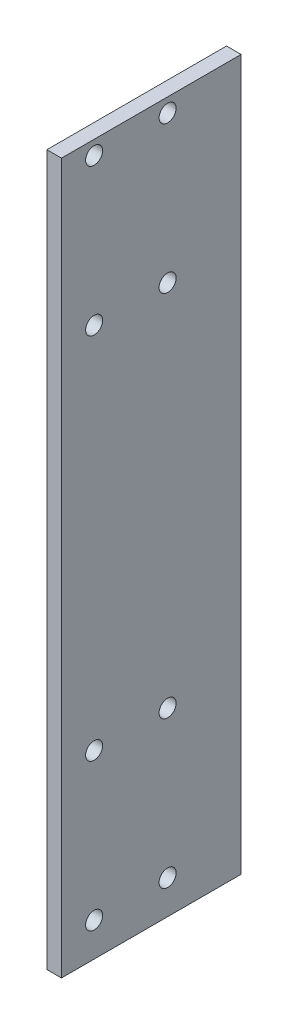
ISO-10303-21;
HEADER;
FILE_DESCRIPTION(('STEP AP214'),'2;1');
FILE_NAME('part.step','',(''),(''),'','','');
FILE_SCHEMA(('AUTOMOTIVE_DESIGN { 1 0 10303 214 1 1 1 1 }'));
ENDSEC;
DATA;
#1=APPLICATION_CONTEXT('core data for automotive mechanical design processes');
#2=APPLICATION_PROTOCOL_DEFINITION('international standard','automotive_design',2000,#1);
#3=PRODUCT_CONTEXT('',#1,'mechanical');
#4=PRODUCT('Part','Part','',(#3));
#5=PRODUCT_RELATED_PRODUCT_CATEGORY('part','',(#4));
#6=PRODUCT_DEFINITION_FORMATION('','',#4);
#7=PRODUCT_DEFINITION_CONTEXT('part definition',#1,'design');
#8=PRODUCT_DEFINITION('design','',#6,#7);
#9=PRODUCT_DEFINITION_SHAPE('','',#8);
#10=(LENGTH_UNIT() NAMED_UNIT(*) SI_UNIT(.MILLI.,.METRE.));
#11=(NAMED_UNIT(*) PLANE_ANGLE_UNIT() SI_UNIT($,.RADIAN.));
#12=(NAMED_UNIT(*) SI_UNIT($,.STERADIAN.) SOLID_ANGLE_UNIT());
#13=UNCERTAINTY_MEASURE_WITH_UNIT(LENGTH_MEASURE(1.E-05),#10,'distance_accuracy_value','');
#14=(GEOMETRIC_REPRESENTATION_CONTEXT(3) GLOBAL_UNCERTAINTY_ASSIGNED_CONTEXT((#13)) GLOBAL_UNIT_ASSIGNED_CONTEXT((#10,
#11,#12)) REPRESENTATION_CONTEXT('',''));
#15=CARTESIAN_POINT('',(0.,0.,0.));
#16=DIRECTION('',(0.,0.,1.));
#17=DIRECTION('',(1.,0.,0.));
#18=AXIS2_PLACEMENT_3D('',#15,#16,#17);
#19=CARTESIAN_POINT('',(3.175,0.,0.));
#20=DIRECTION('',(-1.,0.,0.));
#21=DIRECTION('',(0.,0.,1.));
#22=AXIS2_PLACEMENT_3D('',#19,#20,#21);
#23=PLANE('',#22);
#24=DIRECTION('',(0.,-1.,0.));
#25=VECTOR('',#24,1.);
#26=CARTESIAN_POINT('',(3.175,-23.3590702140001,82.));
#27=LINE('',#26,#25);
#28=CARTESIAN_POINT('',(3.175,131.25,82.));
#29=VERTEX_POINT('',#28);
#30=CARTESIAN_POINT('',(3.175,-23.3590702140001,82.));
#31=VERTEX_POINT('',#30);
#32=EDGE_CURVE('E85',#29,#31,#27,.T.);
#33=ORIENTED_EDGE('',*,*,#32,.T.);
#34=DIRECTION('',(0.,0.,-1.));
#35=VECTOR('',#34,1.);
#36=CARTESIAN_POINT('',(3.175,-23.3590702140001,82.));
#37=LINE('',#36,#35);
#38=CARTESIAN_POINT('',(3.175,-23.3590702140001,42.8868));
#39=VERTEX_POINT('',#38);
#40=EDGE_CURVE('E80',#31,#39,#37,.T.);
#41=ORIENTED_EDGE('',*,*,#40,.T.);
#42=DIRECTION('',(0.,1.,0.));
#43=VECTOR('',#42,1.);
#44=CARTESIAN_POINT('',(3.175,-23.3590702140001,42.8868));
#45=LINE('',#44,#43);
#46=CARTESIAN_POINT('',(3.175,131.25,42.8868));
#47=VERTEX_POINT('',#46);
#48=EDGE_CURVE('E83',#39,#47,#45,.T.);
#49=ORIENTED_EDGE('',*,*,#48,.T.);
#50=DIRECTION('',(0.,0.,1.));
#51=VECTOR('',#50,1.);
#52=CARTESIAN_POINT('',(3.175,131.25,82.));
#53=LINE('',#52,#51);
#54=EDGE_CURVE('E50',#47,#29,#53,.T.);
#55=ORIENTED_EDGE('',*,*,#54,.T.);
#56=EDGE_LOOP('',(#33,#41,#49,#55));
#57=FACE_BOUND('',#56,.T.);
#58=CARTESIAN_POINT('',(3.175,-16.000000003999,74.8897999999996));
#59=DIRECTION('',(1.,0.,0.));
#60=DIRECTION('',(0.,0.,-1.));
#61=AXIS2_PLACEMENT_3D('',#58,#59,#60);
#62=CIRCLE('',#61,1.8542);
#63=CARTESIAN_POINT('',(3.175,-16.000000003999,73.0355999999996));
#64=VERTEX_POINT('',#63);
#65=EDGE_CURVE('E100',#64,#64,#62,.T.);
#66=ORIENTED_EDGE('',*,*,#65,.F.);
#67=EDGE_LOOP('',(#66));
#68=FACE_BOUND('',#67,.T.);
#69=CARTESIAN_POINT('',(3.175,-16.000000003999,58.8897999999996));
#70=DIRECTION('',(1.,0.,0.));
#71=DIRECTION('',(0.,0.,-1.));
#72=AXIS2_PLACEMENT_3D('',#69,#70,#71);
#73=CIRCLE('',#72,1.8542);
#74=CARTESIAN_POINT('',(3.175,-16.000000003999,57.0355999999996));
#75=VERTEX_POINT('',#74);
#76=EDGE_CURVE('E115',#75,#75,#73,.T.);
#77=ORIENTED_EDGE('',*,*,#76,.F.);
#78=EDGE_LOOP('',(#77));
#79=FACE_BOUND('',#78,.T.);
#80=CARTESIAN_POINT('',(3.175,16.000000004001,74.8897999999996));
#81=DIRECTION('',(1.,0.,0.));
#82=DIRECTION('',(0.,0.,-1.));
#83=AXIS2_PLACEMENT_3D('',#80,#81,#82);
#84=CIRCLE('',#83,1.8542);
#85=CARTESIAN_POINT('',(3.175,16.000000004001,73.0355999999996));
#86=VERTEX_POINT('',#85);
#87=EDGE_CURVE('E121',#86,#86,#84,.T.);
#88=ORIENTED_EDGE('',*,*,#87,.F.);
#89=EDGE_LOOP('',(#88));
#90=FACE_BOUND('',#89,.T.);
#91=CARTESIAN_POINT('',(3.175,16.000000004001,58.8897999999996));
#92=DIRECTION('',(1.,0.,0.));
#93=DIRECTION('',(0.,0.,-1.));
#94=AXIS2_PLACEMENT_3D('',#91,#92,#93);
#95=CIRCLE('',#94,1.8542);
#96=CARTESIAN_POINT('',(3.175,16.000000004001,57.0355999999996));
#97=VERTEX_POINT('',#96);
#98=EDGE_CURVE('E127',#97,#97,#95,.T.);
#99=ORIENTED_EDGE('',*,*,#98,.F.);
#100=EDGE_LOOP('',(#99));
#101=FACE_BOUND('',#100,.T.);
#102=CARTESIAN_POINT('',(3.175,128.200000004,74.8897999999996));
#103=DIRECTION('',(1.,0.,0.));
#104=DIRECTION('',(0.,0.,-1.));
#105=AXIS2_PLACEMENT_3D('',#102,#103,#104);
#106=CIRCLE('',#105,1.8542);
#107=CARTESIAN_POINT('',(3.175,128.200000004,73.0355999999996));
#108=VERTEX_POINT('',#107);
#109=EDGE_CURVE('E133',#108,#108,#106,.T.);
#110=ORIENTED_EDGE('',*,*,#109,.F.);
#111=EDGE_LOOP('',(#110));
#112=FACE_BOUND('',#111,.T.);
#113=CARTESIAN_POINT('',(3.175,128.200000004,58.8897999999996));
#114=DIRECTION('',(1.,0.,0.));
#115=DIRECTION('',(0.,0.,-1.));
#116=AXIS2_PLACEMENT_3D('',#113,#114,#115);
#117=CIRCLE('',#116,1.8542);
#118=CARTESIAN_POINT('',(3.175,128.200000004,57.0355999999996));
#119=VERTEX_POINT('',#118);
#120=EDGE_CURVE('E139',#119,#119,#117,.T.);
#121=ORIENTED_EDGE('',*,*,#120,.F.);
#122=EDGE_LOOP('',(#121));
#123=FACE_BOUND('',#122,.T.);
#124=CARTESIAN_POINT('',(3.175,96.199999996,74.8897999999996));
#125=DIRECTION('',(1.,0.,0.));
#126=DIRECTION('',(0.,0.,-1.));
#127=AXIS2_PLACEMENT_3D('',#124,#125,#126);
#128=CIRCLE('',#127,1.8542);
#129=CARTESIAN_POINT('',(3.175,96.199999996,73.0355999999996));
#130=VERTEX_POINT('',#129);
#131=EDGE_CURVE('E145',#130,#130,#128,.T.);
#132=ORIENTED_EDGE('',*,*,#131,.F.);
#133=EDGE_LOOP('',(#132));
#134=FACE_BOUND('',#133,.T.);
#135=CARTESIAN_POINT('',(3.175,96.199999996,58.8897999999996));
#136=DIRECTION('',(1.,0.,0.));
#137=DIRECTION('',(0.,0.,-1.));
#138=AXIS2_PLACEMENT_3D('',#135,#136,#137);
#139=CIRCLE('',#138,1.85420000000001);
#140=CARTESIAN_POINT('',(3.175,96.199999996,57.0355999999996));
#141=VERTEX_POINT('',#140);
#142=EDGE_CURVE('E151',#141,#141,#139,.T.);
#143=ORIENTED_EDGE('',*,*,#142,.F.);
#144=EDGE_LOOP('',(#143));
#145=FACE_BOUND('',#144,.T.);
#146=ADVANCED_FACE('F33',(#57,#68,#79,#90,#101,#112,#123,#134,#145),#23,.F.);
#147=CARTESIAN_POINT('',(0.,0.,0.));
#148=DIRECTION('',(-1.,0.,0.));
#149=DIRECTION('',(0.,0.,1.));
#150=AXIS2_PLACEMENT_3D('',#147,#148,#149);
#151=PLANE('',#150);
#152=CARTESIAN_POINT('',(0.,96.199999996,74.8897999999996));
#153=DIRECTION('',(1.,0.,0.));
#154=DIRECTION('',(0.,0.,-1.));
#155=AXIS2_PLACEMENT_3D('',#152,#153,#154);
#156=CIRCLE('',#155,1.8542);
#157=CARTESIAN_POINT('',(0.,96.199999996,73.0355999999996));
#158=VERTEX_POINT('',#157);
#159=EDGE_CURVE('E148',#158,#158,#156,.T.);
#160=ORIENTED_EDGE('',*,*,#159,.T.);
#161=EDGE_LOOP('',(#160));
#162=FACE_BOUND('',#161,.T.);
#163=CARTESIAN_POINT('',(0.,128.200000004,74.8897999999996));
#164=DIRECTION('',(1.,0.,0.));
#165=DIRECTION('',(0.,0.,-1.));
#166=AXIS2_PLACEMENT_3D('',#163,#164,#165);
#167=CIRCLE('',#166,1.8542);
#168=CARTESIAN_POINT('',(0.,128.200000004,73.0355999999996));
#169=VERTEX_POINT('',#168);
#170=EDGE_CURVE('E136',#169,#169,#167,.T.);
#171=ORIENTED_EDGE('',*,*,#170,.T.);
#172=EDGE_LOOP('',(#171));
#173=FACE_BOUND('',#172,.T.);
#174=CARTESIAN_POINT('',(0.,16.000000004001,74.8897999999996));
#175=DIRECTION('',(1.,0.,0.));
#176=DIRECTION('',(0.,0.,-1.));
#177=AXIS2_PLACEMENT_3D('',#174,#175,#176);
#178=CIRCLE('',#177,1.8542);
#179=CARTESIAN_POINT('',(0.,16.000000004001,73.0355999999996));
#180=VERTEX_POINT('',#179);
#181=EDGE_CURVE('E124',#180,#180,#178,.T.);
#182=ORIENTED_EDGE('',*,*,#181,.T.);
#183=EDGE_LOOP('',(#182));
#184=FACE_BOUND('',#183,.T.);
#185=CARTESIAN_POINT('',(0.,-16.000000003999,74.8897999999996));
#186=DIRECTION('',(1.,0.,0.));
#187=DIRECTION('',(0.,0.,-1.));
#188=AXIS2_PLACEMENT_3D('',#185,#186,#187);
#189=CIRCLE('',#188,1.8542);
#190=CARTESIAN_POINT('',(0.,-16.000000003999,73.0355999999996));
#191=VERTEX_POINT('',#190);
#192=EDGE_CURVE('E112',#191,#191,#189,.T.);
#193=ORIENTED_EDGE('',*,*,#192,.T.);
#194=EDGE_LOOP('',(#193));
#195=FACE_BOUND('',#194,.T.);
#196=DIRECTION('',(0.,-1.,0.));
#197=VECTOR('',#196,1.);
#198=CARTESIAN_POINT('',(0.,-23.3590702140001,82.));
#199=LINE('',#198,#197);
#200=CARTESIAN_POINT('',(0.,131.25,82.));
#201=VERTEX_POINT('',#200);
#202=CARTESIAN_POINT('',(0.,-23.3590702140001,82.));
#203=VERTEX_POINT('',#202);
#204=EDGE_CURVE('E97',#201,#203,#199,.T.);
#205=ORIENTED_EDGE('',*,*,#204,.F.);
#206=DIRECTION('',(0.,0.,1.));
#207=VECTOR('',#206,1.);
#208=CARTESIAN_POINT('',(0.,131.25,82.));
#209=LINE('',#208,#207);
#210=CARTESIAN_POINT('',(0.,131.25,42.8868));
#211=VERTEX_POINT('',#210);
#212=EDGE_CURVE('E73',#211,#201,#209,.T.);
#213=ORIENTED_EDGE('',*,*,#212,.F.);
#214=DIRECTION('',(0.,1.,0.));
#215=VECTOR('',#214,1.);
#216=CARTESIAN_POINT('',(0.,-23.3590702140001,42.8868));
#217=LINE('',#216,#215);
#218=CARTESIAN_POINT('',(0.,-23.3590702140001,42.8868));
#219=VERTEX_POINT('',#218);
#220=EDGE_CURVE('E67',#219,#211,#217,.T.);
#221=ORIENTED_EDGE('',*,*,#220,.F.);
#222=DIRECTION('',(0.,0.,-1.));
#223=VECTOR('',#222,1.);
#224=CARTESIAN_POINT('',(0.,-23.3590702140001,82.));
#225=LINE('',#224,#223);
#226=EDGE_CURVE('E89',#203,#219,#225,.T.);
#227=ORIENTED_EDGE('',*,*,#226,.F.);
#228=EDGE_LOOP('',(#205,#213,#221,#227));
#229=FACE_BOUND('',#228,.T.);
#230=CARTESIAN_POINT('',(0.,-16.000000003999,58.8897999999996));
#231=DIRECTION('',(1.,0.,0.));
#232=DIRECTION('',(0.,0.,-1.));
#233=AXIS2_PLACEMENT_3D('',#230,#231,#232);
#234=CIRCLE('',#233,1.8542);
#235=CARTESIAN_POINT('',(0.,-16.000000003999,57.0355999999996));
#236=VERTEX_POINT('',#235);
#237=EDGE_CURVE('E118',#236,#236,#234,.T.);
#238=ORIENTED_EDGE('',*,*,#237,.T.);
#239=EDGE_LOOP('',(#238));
#240=FACE_BOUND('',#239,.T.);
#241=CARTESIAN_POINT('',(0.,16.000000004001,58.8897999999996));
#242=DIRECTION('',(1.,0.,0.));
#243=DIRECTION('',(0.,0.,-1.));
#244=AXIS2_PLACEMENT_3D('',#241,#242,#243);
#245=CIRCLE('',#244,1.8542);
#246=CARTESIAN_POINT('',(0.,16.000000004001,57.0355999999996));
#247=VERTEX_POINT('',#246);
#248=EDGE_CURVE('E130',#247,#247,#245,.T.);
#249=ORIENTED_EDGE('',*,*,#248,.T.);
#250=EDGE_LOOP('',(#249));
#251=FACE_BOUND('',#250,.T.);
#252=CARTESIAN_POINT('',(0.,128.200000004,58.8897999999996));
#253=DIRECTION('',(1.,0.,0.));
#254=DIRECTION('',(0.,0.,-1.));
#255=AXIS2_PLACEMENT_3D('',#252,#253,#254);
#256=CIRCLE('',#255,1.8542);
#257=CARTESIAN_POINT('',(0.,128.200000004,57.0355999999996));
#258=VERTEX_POINT('',#257);
#259=EDGE_CURVE('E142',#258,#258,#256,.T.);
#260=ORIENTED_EDGE('',*,*,#259,.T.);
#261=EDGE_LOOP('',(#260));
#262=FACE_BOUND('',#261,.T.);
#263=CARTESIAN_POINT('',(0.,96.199999996,58.8897999999996));
#264=DIRECTION('',(1.,0.,0.));
#265=DIRECTION('',(0.,0.,-1.));
#266=AXIS2_PLACEMENT_3D('',#263,#264,#265);
#267=CIRCLE('',#266,1.85420000000001);
#268=CARTESIAN_POINT('',(0.,96.199999996,57.0355999999996));
#269=VERTEX_POINT('',#268);
#270=EDGE_CURVE('E154',#269,#269,#267,.T.);
#271=ORIENTED_EDGE('',*,*,#270,.T.);
#272=EDGE_LOOP('',(#271));
#273=FACE_BOUND('',#272,.T.);
#274=ADVANCED_FACE('F108',(#162,#173,#184,#195,#229,#240,#251,#262,#273),#151,.T.);
#275=CARTESIAN_POINT('',(3.175,-23.3590702140001,82.));
#276=DIRECTION('',(0.,0.,-1.));
#277=DIRECTION('',(-1.,0.,0.));
#278=AXIS2_PLACEMENT_3D('',#275,#276,#277);
#279=PLANE('',#278);
#280=ORIENTED_EDGE('',*,*,#204,.T.);
#281=DIRECTION('',(-1.,0.,0.));
#282=VECTOR('',#281,1.);
#283=CARTESIAN_POINT('',(3.175,-23.3590702140001,82.));
#284=LINE('',#283,#282);
#285=EDGE_CURVE('E11',#31,#203,#284,.T.);
#286=ORIENTED_EDGE('',*,*,#285,.F.);
#287=ORIENTED_EDGE('',*,*,#32,.F.);
#288=DIRECTION('',(-1.,0.,0.));
#289=VECTOR('',#288,1.);
#290=CARTESIAN_POINT('',(3.175,131.25,82.));
#291=LINE('',#290,#289);
#292=EDGE_CURVE('E93',#29,#201,#291,.T.);
#293=ORIENTED_EDGE('',*,*,#292,.T.);
#294=EDGE_LOOP('',(#280,#286,#287,#293));
#295=FACE_BOUND('',#294,.T.);
#296=ADVANCED_FACE('F35',(#295),#279,.F.);
#297=CARTESIAN_POINT('',(3.175,-23.3590702140001,82.));
#298=DIRECTION('',(0.,1.,0.));
#299=DIRECTION('',(0.,0.,1.));
#300=AXIS2_PLACEMENT_3D('',#297,#298,#299);
#301=PLANE('',#300);
#302=ORIENTED_EDGE('',*,*,#226,.T.);
#303=DIRECTION('',(-1.,0.,0.));
#304=VECTOR('',#303,1.);
#305=CARTESIAN_POINT('',(3.175,-23.3590702140001,42.8868));
#306=LINE('',#305,#304);
#307=EDGE_CURVE('E42',#39,#219,#306,.T.);
#308=ORIENTED_EDGE('',*,*,#307,.F.);
#309=ORIENTED_EDGE('',*,*,#40,.F.);
#310=ORIENTED_EDGE('',*,*,#285,.T.);
#311=EDGE_LOOP('',(#302,#308,#309,#310));
#312=FACE_BOUND('',#311,.T.);
#313=ADVANCED_FACE('F88',(#312),#301,.F.);
#314=CARTESIAN_POINT('',(3.175,-23.3590702140001,42.8868));
#315=DIRECTION('',(0.,0.,1.));
#316=DIRECTION('',(1.,0.,0.));
#317=AXIS2_PLACEMENT_3D('',#314,#315,#316);
#318=PLANE('',#317);
#319=ORIENTED_EDGE('',*,*,#220,.T.);
#320=DIRECTION('',(-1.,0.,0.));
#321=VECTOR('',#320,1.);
#322=CARTESIAN_POINT('',(3.175,131.25,42.8868));
#323=LINE('',#322,#321);
#324=EDGE_CURVE('E90',#47,#211,#323,.T.);
#325=ORIENTED_EDGE('',*,*,#324,.F.);
#326=ORIENTED_EDGE('',*,*,#48,.F.);
#327=ORIENTED_EDGE('',*,*,#307,.T.);
#328=EDGE_LOOP('',(#319,#325,#326,#327));
#329=FACE_BOUND('',#328,.T.);
#330=ADVANCED_FACE('F91',(#329),#318,.F.);
#331=CARTESIAN_POINT('',(3.175,131.25,82.));
#332=DIRECTION('',(0.,-1.,0.));
#333=DIRECTION('',(0.,0.,-1.));
#334=AXIS2_PLACEMENT_3D('',#331,#332,#333);
#335=PLANE('',#334);
#336=ORIENTED_EDGE('',*,*,#212,.T.);
#337=ORIENTED_EDGE('',*,*,#292,.F.);
#338=ORIENTED_EDGE('',*,*,#54,.F.);
#339=ORIENTED_EDGE('',*,*,#324,.T.);
#340=EDGE_LOOP('',(#336,#337,#338,#339));
#341=FACE_BOUND('',#340,.T.);
#342=ADVANCED_FACE('F105',(#341),#335,.F.);
#343=CARTESIAN_POINT('',(3.175,-16.000000003999,74.8897999999996));
#344=DIRECTION('',(-1.,0.,0.));
#345=DIRECTION('',(0.,0.,1.));
#346=AXIS2_PLACEMENT_3D('',#343,#344,#345);
#347=CYLINDRICAL_SURFACE('',#346,1.8542);
#348=ORIENTED_EDGE('',*,*,#65,.T.);
#349=EDGE_LOOP('',(#348));
#350=FACE_BOUND('',#349,.T.);
#351=ORIENTED_EDGE('',*,*,#192,.F.);
#352=EDGE_LOOP('',(#351));
#353=FACE_BOUND('',#352,.T.);
#354=ADVANCED_FACE('F171',(#350,#353),#347,.F.);
#355=CARTESIAN_POINT('',(3.175,-16.000000003999,58.8897999999996));
#356=DIRECTION('',(-1.,0.,0.));
#357=DIRECTION('',(0.,0.,1.));
#358=AXIS2_PLACEMENT_3D('',#355,#356,#357);
#359=CYLINDRICAL_SURFACE('',#358,1.8542);
#360=ORIENTED_EDGE('',*,*,#76,.T.);
#361=EDGE_LOOP('',(#360));
#362=FACE_BOUND('',#361,.T.);
#363=ORIENTED_EDGE('',*,*,#237,.F.);
#364=EDGE_LOOP('',(#363));
#365=FACE_BOUND('',#364,.T.);
#366=ADVANCED_FACE('F217',(#362,#365),#359,.F.);
#367=CARTESIAN_POINT('',(3.175,16.000000004001,74.8897999999996));
#368=DIRECTION('',(-1.,0.,0.));
#369=DIRECTION('',(0.,0.,1.));
#370=AXIS2_PLACEMENT_3D('',#367,#368,#369);
#371=CYLINDRICAL_SURFACE('',#370,1.8542);
#372=ORIENTED_EDGE('',*,*,#87,.T.);
#373=EDGE_LOOP('',(#372));
#374=FACE_BOUND('',#373,.T.);
#375=ORIENTED_EDGE('',*,*,#181,.F.);
#376=EDGE_LOOP('',(#375));
#377=FACE_BOUND('',#376,.T.);
#378=ADVANCED_FACE('F225',(#374,#377),#371,.F.);
#379=CARTESIAN_POINT('',(3.175,16.000000004001,58.8897999999996));
#380=DIRECTION('',(-1.,0.,0.));
#381=DIRECTION('',(0.,0.,1.));
#382=AXIS2_PLACEMENT_3D('',#379,#380,#381);
#383=CYLINDRICAL_SURFACE('',#382,1.8542);
#384=ORIENTED_EDGE('',*,*,#98,.T.);
#385=EDGE_LOOP('',(#384));
#386=FACE_BOUND('',#385,.T.);
#387=ORIENTED_EDGE('',*,*,#248,.F.);
#388=EDGE_LOOP('',(#387));
#389=FACE_BOUND('',#388,.T.);
#390=ADVANCED_FACE('F233',(#386,#389),#383,.F.);
#391=CARTESIAN_POINT('',(3.175,128.200000004,74.8897999999996));
#392=DIRECTION('',(-1.,0.,0.));
#393=DIRECTION('',(0.,0.,1.));
#394=AXIS2_PLACEMENT_3D('',#391,#392,#393);
#395=CYLINDRICAL_SURFACE('',#394,1.8542);
#396=ORIENTED_EDGE('',*,*,#109,.T.);
#397=EDGE_LOOP('',(#396));
#398=FACE_BOUND('',#397,.T.);
#399=ORIENTED_EDGE('',*,*,#170,.F.);
#400=EDGE_LOOP('',(#399));
#401=FACE_BOUND('',#400,.T.);
#402=ADVANCED_FACE('F242',(#398,#401),#395,.F.);
#403=CARTESIAN_POINT('',(3.175,128.200000004,58.8897999999996));
#404=DIRECTION('',(-1.,0.,0.));
#405=DIRECTION('',(0.,0.,1.));
#406=AXIS2_PLACEMENT_3D('',#403,#404,#405);
#407=CYLINDRICAL_SURFACE('',#406,1.8542);
#408=ORIENTED_EDGE('',*,*,#120,.T.);
#409=EDGE_LOOP('',(#408));
#410=FACE_BOUND('',#409,.T.);
#411=ORIENTED_EDGE('',*,*,#259,.F.);
#412=EDGE_LOOP('',(#411));
#413=FACE_BOUND('',#412,.T.);
#414=ADVANCED_FACE('F251',(#410,#413),#407,.F.);
#415=CARTESIAN_POINT('',(3.175,96.199999996,74.8897999999996));
#416=DIRECTION('',(-1.,0.,0.));
#417=DIRECTION('',(0.,0.,1.));
#418=AXIS2_PLACEMENT_3D('',#415,#416,#417);
#419=CYLINDRICAL_SURFACE('',#418,1.8542);
#420=ORIENTED_EDGE('',*,*,#131,.T.);
#421=EDGE_LOOP('',(#420));
#422=FACE_BOUND('',#421,.T.);
#423=ORIENTED_EDGE('',*,*,#159,.F.);
#424=EDGE_LOOP('',(#423));
#425=FACE_BOUND('',#424,.T.);
#426=ADVANCED_FACE('F260',(#422,#425),#419,.F.);
#427=CARTESIAN_POINT('',(3.175,96.199999996,58.8897999999996));
#428=DIRECTION('',(-1.,0.,0.));
#429=DIRECTION('',(0.,0.,1.));
#430=AXIS2_PLACEMENT_3D('',#427,#428,#429);
#431=CYLINDRICAL_SURFACE('',#430,1.85420000000001);
#432=ORIENTED_EDGE('',*,*,#142,.T.);
#433=EDGE_LOOP('',(#432));
#434=FACE_BOUND('',#433,.T.);
#435=ORIENTED_EDGE('',*,*,#270,.F.);
#436=EDGE_LOOP('',(#435));
#437=FACE_BOUND('',#436,.T.);
#438=ADVANCED_FACE('F160',(#434,#437),#431,.F.);
#439=CLOSED_SHELL('',(#146,#274,#296,#313,#330,#342,#354,#366,#378,#390,#402,#414,#426,#438));
#440=MANIFOLD_SOLID_BREP('B2',#439);
#441=ADVANCED_BREP_SHAPE_REPRESENTATION('',(#18,#440),#14);
#442=SHAPE_DEFINITION_REPRESENTATION(#9,#441);
ENDSEC;
END-ISO-10303-21;
